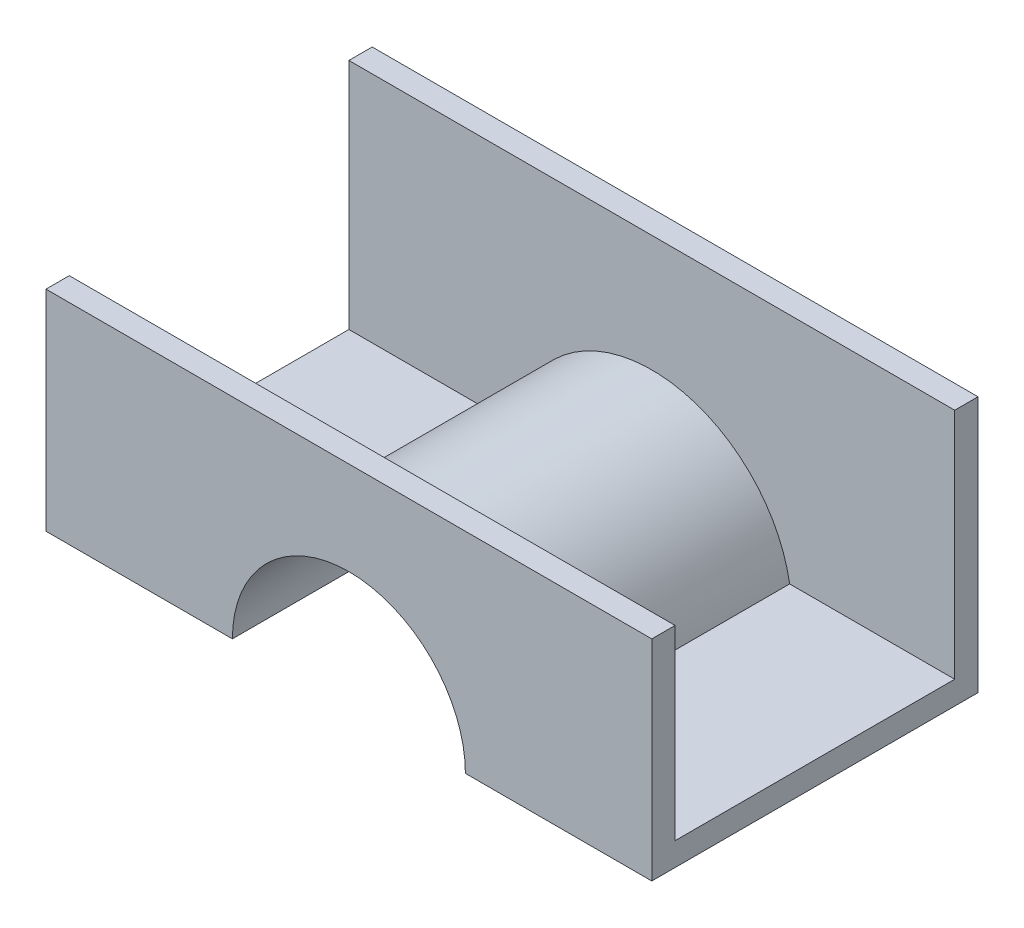
ISO-10303-21;
HEADER;
FILE_DESCRIPTION(('STEP AP214'),'2;1');
FILE_NAME('part.step','',(''),(''),'','','');
FILE_SCHEMA(('AUTOMOTIVE_DESIGN { 1 0 10303 214 1 1 1 1 }'));
ENDSEC;
DATA;
#1=APPLICATION_CONTEXT('core data for automotive mechanical design processes');
#2=APPLICATION_PROTOCOL_DEFINITION('international standard','automotive_design',2000,#1);
#3=PRODUCT_CONTEXT('',#1,'mechanical');
#4=PRODUCT('Part','Part','',(#3));
#5=PRODUCT_RELATED_PRODUCT_CATEGORY('part','',(#4));
#6=PRODUCT_DEFINITION_FORMATION('','',#4);
#7=PRODUCT_DEFINITION_CONTEXT('part definition',#1,'design');
#8=PRODUCT_DEFINITION('design','',#6,#7);
#9=PRODUCT_DEFINITION_SHAPE('','',#8);
#10=(LENGTH_UNIT() NAMED_UNIT(*) SI_UNIT(.MILLI.,.METRE.));
#11=(NAMED_UNIT(*) PLANE_ANGLE_UNIT() SI_UNIT($,.RADIAN.));
#12=(NAMED_UNIT(*) SI_UNIT($,.STERADIAN.) SOLID_ANGLE_UNIT());
#13=UNCERTAINTY_MEASURE_WITH_UNIT(LENGTH_MEASURE(1.E-05),#10,'distance_accuracy_value','');
#14=(GEOMETRIC_REPRESENTATION_CONTEXT(3) GLOBAL_UNCERTAINTY_ASSIGNED_CONTEXT((#13)) GLOBAL_UNIT_ASSIGNED_CONTEXT((#10,
#11,#12)) REPRESENTATION_CONTEXT('',''));
#15=CARTESIAN_POINT('',(0.,0.,0.));
#16=DIRECTION('',(0.,0.,1.));
#17=DIRECTION('',(1.,0.,0.));
#18=AXIS2_PLACEMENT_3D('',#15,#16,#17);
#19=CARTESIAN_POINT('',(-0.0053435001997926,-1.44244159005576,0.00476642100056624));
#20=DIRECTION('',(-1.62409768173737E-13,0.,1.));
#21=DIRECTION('',(1.,0.,1.62409768173737E-13));
#22=AXIS2_PLACEMENT_3D('',#19,#20,#21);
#23=CYLINDRICAL_SURFACE('',#22,0.150000000000034);
#24=CARTESIAN_POINT('',(-0.00534350019984539,-1.44244159005576,0.329766421000602));
#25=DIRECTION('',(-1.62409768173737E-13,0.,1.));
#26=DIRECTION('',(1.,0.,1.62409768173737E-13));
#27=AXIS2_PLACEMENT_3D('',#24,#25,#26);
#28=CIRCLE('',#27,0.150000000000034);
#29=CARTESIAN_POINT('',(0.142558494377718,-1.41744159005576,0.329766421000584));
#30=VERTEX_POINT('',#29);
#31=CARTESIAN_POINT('',(-0.153245494777348,-1.4174415900558,0.329766421000584));
#32=VERTEX_POINT('',#31);
#33=EDGE_CURVE('E11',#30,#32,#28,.T.);
#34=ORIENTED_EDGE('',*,*,#33,.F.);
#35=DIRECTION('',(0.,0.,1.));
#36=VECTOR('',#35,1.);
#37=CARTESIAN_POINT('',(0.142558494377757,-1.41744159005577,0.329766421000566));
#38=LINE('',#37,#36);
#39=CARTESIAN_POINT('',(0.142558494377744,-1.41744159005577,0.0297664210005483));
#40=VERTEX_POINT('',#39);
#41=EDGE_CURVE('E24',#40,#30,#38,.T.);
#42=ORIENTED_EDGE('',*,*,#41,.F.);
#43=CARTESIAN_POINT('',(-0.00534350019979666,-1.44244159005576,0.0297664210005303));
#44=DIRECTION('',(1.62409768173737E-13,0.,-1.));
#45=DIRECTION('',(1.,0.,1.62409768173737E-13));
#46=AXIS2_PLACEMENT_3D('',#43,#44,#45);
#47=CIRCLE('',#46,0.150000000000034);
#48=CARTESIAN_POINT('',(-0.153245494777319,-1.41744159005581,0.0297664210005363));
#49=VERTEX_POINT('',#48);
#50=EDGE_CURVE('E203',#49,#40,#47,.T.);
#51=ORIENTED_EDGE('',*,*,#50,.F.);
#52=DIRECTION('',(0.,0.,-1.));
#53=VECTOR('',#52,1.);
#54=CARTESIAN_POINT('',(-0.153245494777319,-1.4174415900558,0.329766421000566));
#55=LINE('',#54,#53);
#56=EDGE_CURVE('E200',#32,#49,#55,.T.);
#57=ORIENTED_EDGE('',*,*,#56,.F.);
#58=EDGE_LOOP('',(#34,#42,#51,#57));
#59=FACE_BOUND('',#58,.T.);
#60=ADVANCED_FACE('F17',(#59),#23,.T.);
#61=CARTESIAN_POINT('',(0.31965649980025,-1.41744159005575,0.329766421000566));
#62=DIRECTION('',(-1.01196828694583E-13,1.,0.));
#63=DIRECTION('',(-1.,-1.01196828694583E-13,0.));
#64=AXIS2_PLACEMENT_3D('',#61,#62,#63);
#65=PLANE('',#64);
#66=ORIENTED_EDGE('',*,*,#41,.T.);
#67=DIRECTION('',(-1.,0.,0.));
#68=VECTOR('',#67,1.);
#69=CARTESIAN_POINT('',(0.319656499800225,-1.41744159005575,0.329766421000566));
#70=LINE('',#69,#68);
#71=CARTESIAN_POINT('',(0.319656499800244,-1.41744159005575,0.329766421000566));
#72=VERTEX_POINT('',#71);
#73=EDGE_CURVE('E198',#72,#30,#70,.T.);
#74=ORIENTED_EDGE('',*,*,#73,.F.);
#75=DIRECTION('',(0.,0.,1.));
#76=VECTOR('',#75,1.);
#77=CARTESIAN_POINT('',(0.31965649980025,-1.41744159005575,0.354766421000566));
#78=LINE('',#77,#76);
#79=CARTESIAN_POINT('',(0.31965649980025,-1.41744159005576,0.0297664210005663));
#80=VERTEX_POINT('',#79);
#81=EDGE_CURVE('E195',#80,#72,#78,.T.);
#82=ORIENTED_EDGE('',*,*,#81,.F.);
#83=DIRECTION('',(1.,0.,0.));
#84=VECTOR('',#83,1.);
#85=CARTESIAN_POINT('',(-0.00534350019975086,-1.41744159005577,0.0297664210005663));
#86=LINE('',#85,#84);
#87=EDGE_CURVE('E192',#40,#80,#86,.T.);
#88=ORIENTED_EDGE('',*,*,#87,.F.);
#89=EDGE_LOOP('',(#66,#74,#82,#88));
#90=FACE_BOUND('',#89,.T.);
#91=ADVANCED_FACE('F207',(#90),#65,.T.);
#92=CARTESIAN_POINT('',(-0.00534350019981537,-1.2174415900558,0.342266421000566));
#93=DIRECTION('',(-1.01196828694126E-13,1.,0.));
#94=DIRECTION('',(-1.,-1.01196828694126E-13,0.));
#95=AXIS2_PLACEMENT_3D('',#92,#93,#94);
#96=PLANE('',#95);
#97=DIRECTION('',(1.,0.,0.));
#98=VECTOR('',#97,1.);
#99=CARTESIAN_POINT('',(0.319656499800225,-1.21744159005583,0.329766421000566));
#100=LINE('',#99,#98);
#101=CARTESIAN_POINT('',(-0.330343500199747,-1.21744159005583,0.329766421000566));
#102=VERTEX_POINT('',#101);
#103=CARTESIAN_POINT('',(0.31965649980023,-1.21744159005579,0.329766421000566));
#104=VERTEX_POINT('',#103);
#105=EDGE_CURVE('E190',#102,#104,#100,.T.);
#106=ORIENTED_EDGE('',*,*,#105,.F.);
#107=DIRECTION('',(0.,0.,-1.));
#108=VECTOR('',#107,1.);
#109=CARTESIAN_POINT('',(-0.330343500199747,-1.21744159005583,0.329766421000566));
#110=LINE('',#109,#108);
#111=CARTESIAN_POINT('',(-0.330343500199747,-1.21744159005581,0.354766421000566));
#112=VERTEX_POINT('',#111);
#113=EDGE_CURVE('E187',#112,#102,#110,.T.);
#114=ORIENTED_EDGE('',*,*,#113,.F.);
#115=DIRECTION('',(-1.,0.,0.));
#116=VECTOR('',#115,1.);
#117=CARTESIAN_POINT('',(-0.330343500199752,-1.21744159005576,0.354766421000566));
#118=LINE('',#117,#116);
#119=CARTESIAN_POINT('',(0.319656499800238,-1.21744159005576,0.354766421000566));
#120=VERTEX_POINT('',#119);
#121=EDGE_CURVE('E184',#120,#112,#118,.T.);
#122=ORIENTED_EDGE('',*,*,#121,.F.);
#123=DIRECTION('',(0.,0.,1.));
#124=VECTOR('',#123,1.);
#125=CARTESIAN_POINT('',(0.31965649980023,-1.21744159005576,0.354766421000566));
#126=LINE('',#125,#124);
#127=EDGE_CURVE('E181',#104,#120,#126,.T.);
#128=ORIENTED_EDGE('',*,*,#127,.F.);
#129=EDGE_LOOP('',(#106,#114,#122,#128));
#130=FACE_BOUND('',#129,.T.);
#131=ADVANCED_FACE('F226',(#130),#96,.T.);
#132=CARTESIAN_POINT('',(0.319656499800225,-1.16744159005575,0.329766421000566));
#133=DIRECTION('',(0.,0.,-1.));
#134=DIRECTION('',(-1.,0.,0.));
#135=AXIS2_PLACEMENT_3D('',#132,#133,#134);
#136=PLANE('',#135);
#137=ORIENTED_EDGE('',*,*,#73,.T.);
#138=ORIENTED_EDGE('',*,*,#33,.T.);
#139=DIRECTION('',(1.,1.01196828694583E-13,0.));
#140=VECTOR('',#139,1.);
#141=CARTESIAN_POINT('',(0.31965649980025,-1.41744159005575,0.329766421000566));
#142=LINE('',#141,#140);
#143=CARTESIAN_POINT('',(-0.330343500199727,-1.41744159005582,0.329766421000566));
#144=VERTEX_POINT('',#143);
#145=EDGE_CURVE('E178',#144,#32,#142,.T.);
#146=ORIENTED_EDGE('',*,*,#145,.F.);
#147=DIRECTION('',(1.01196828694583E-13,-1.,0.));
#148=VECTOR('',#147,1.);
#149=CARTESIAN_POINT('',(-0.330343500199752,-1.16744159005582,0.329766421000566));
#150=LINE('',#149,#148);
#151=EDGE_CURVE('E175',#102,#144,#150,.T.);
#152=ORIENTED_EDGE('',*,*,#151,.F.);
#153=ORIENTED_EDGE('',*,*,#105,.T.);
#154=DIRECTION('',(-1.01196828694583E-13,1.,0.));
#155=VECTOR('',#154,1.);
#156=CARTESIAN_POINT('',(0.319656499800225,-1.16744159005575,0.329766421000566));
#157=LINE('',#156,#155);
#158=EDGE_CURVE('E172',#72,#104,#157,.T.);
#159=ORIENTED_EDGE('',*,*,#158,.F.);
#160=EDGE_LOOP('',(#137,#138,#146,#152,#153,#159));
#161=FACE_BOUND('',#160,.T.);
#162=ADVANCED_FACE('F209',(#161),#136,.T.);
#163=CARTESIAN_POINT('',(0.31965649980025,-1.41744159005575,0.329766421000566));
#164=DIRECTION('',(-1.01196828694583E-13,1.,0.));
#165=DIRECTION('',(-1.,-1.01196828694583E-13,0.));
#166=AXIS2_PLACEMENT_3D('',#163,#164,#165);
#167=PLANE('',#166);
#168=ORIENTED_EDGE('',*,*,#56,.T.);
#169=DIRECTION('',(1.,0.,0.));
#170=VECTOR('',#169,1.);
#171=CARTESIAN_POINT('',(-0.00534350019975086,-1.41744159005582,0.0297664210005663));
#172=LINE('',#171,#170);
#173=CARTESIAN_POINT('',(-0.330343500199735,-1.41744159005582,0.0297664210005663));
#174=VERTEX_POINT('',#173);
#175=EDGE_CURVE('E169',#174,#49,#172,.T.);
#176=ORIENTED_EDGE('',*,*,#175,.F.);
#177=DIRECTION('',(0.,0.,-1.));
#178=VECTOR('',#177,1.);
#179=CARTESIAN_POINT('',(-0.330343500199727,-1.41744159005582,0.329766421000566));
#180=LINE('',#179,#178);
#181=EDGE_CURVE('E166',#144,#174,#180,.T.);
#182=ORIENTED_EDGE('',*,*,#181,.F.);
#183=ORIENTED_EDGE('',*,*,#145,.T.);
#184=EDGE_LOOP('',(#168,#176,#182,#183));
#185=FACE_BOUND('',#184,.T.);
#186=ADVANCED_FACE('F220',(#185),#167,.T.);
#187=CARTESIAN_POINT('',(-0.00534350019975086,-1.29244159005581,0.0297664210005663));
#188=DIRECTION('',(0.,0.,1.));
#189=DIRECTION('',(1.,0.,0.));
#190=AXIS2_PLACEMENT_3D('',#187,#188,#189);
#191=PLANE('',#190);
#192=DIRECTION('',(1.01196828694583E-13,-1.,0.));
#193=VECTOR('',#192,1.);
#194=CARTESIAN_POINT('',(0.319656499800225,-1.16744159005575,0.0297664210005664));
#195=LINE('',#194,#193);
#196=CARTESIAN_POINT('',(0.319656499800225,-1.16744159005578,0.0297664210005664));
#197=VERTEX_POINT('',#196);
#198=EDGE_CURVE('E163',#197,#80,#195,.T.);
#199=ORIENTED_EDGE('',*,*,#198,.F.);
#200=DIRECTION('',(1.,1.01196828694583E-13,0.));
#201=VECTOR('',#200,1.);
#202=CARTESIAN_POINT('',(-0.330343500199695,-1.16744159005585,0.0297664210005664));
#203=LINE('',#202,#201);
#204=CARTESIAN_POINT('',(-0.330343500199752,-1.16744159005585,0.0297664210005664));
#205=VERTEX_POINT('',#204);
#206=EDGE_CURVE('E160',#205,#197,#203,.T.);
#207=ORIENTED_EDGE('',*,*,#206,.F.);
#208=DIRECTION('',(-1.01196828694583E-13,1.,0.));
#209=VECTOR('',#208,1.);
#210=CARTESIAN_POINT('',(-0.330343500199752,-1.16744159005582,0.0297664210005664));
#211=LINE('',#210,#209);
#212=EDGE_CURVE('E157',#174,#205,#211,.T.);
#213=ORIENTED_EDGE('',*,*,#212,.F.);
#214=ORIENTED_EDGE('',*,*,#175,.T.);
#215=ORIENTED_EDGE('',*,*,#50,.T.);
#216=ORIENTED_EDGE('',*,*,#87,.T.);
#217=EDGE_LOOP('',(#199,#207,#213,#214,#215,#216));
#218=FACE_BOUND('',#217,.T.);
#219=ADVANCED_FACE('F217',(#218),#191,.T.);
#220=CARTESIAN_POINT('',(-0.330343500199752,-1.16744159005582,0.354766421000566));
#221=DIRECTION('',(0.,0.,1.));
#222=DIRECTION('',(1.,0.,0.));
#223=AXIS2_PLACEMENT_3D('',#220,#221,#222);
#224=PLANE('',#223);
#225=DIRECTION('',(-1.,-1.01196828694583E-13,0.));
#226=VECTOR('',#225,1.);
#227=CARTESIAN_POINT('',(-0.130343500199736,-1.4424415900558,0.354766421000546));
#228=LINE('',#227,#226);
#229=CARTESIAN_POINT('',(-0.130343500199792,-1.4424415900558,0.354766421000556));
#230=VERTEX_POINT('',#229);
#231=CARTESIAN_POINT('',(-0.330343500199724,-1.44244159005582,0.354766421000553));
#232=VERTEX_POINT('',#231);
#233=EDGE_CURVE('E155',#230,#232,#228,.T.);
#234=ORIENTED_EDGE('',*,*,#233,.F.);
#235=CARTESIAN_POINT('',(-0.00534350019979253,-1.44244159005582,0.354766421000566));
#236=DIRECTION('',(1.62409768173737E-13,0.,-1.));
#237=DIRECTION('',(1.,0.,1.62409768173737E-13));
#238=AXIS2_PLACEMENT_3D('',#235,#236,#237);
#239=CIRCLE('',#238,0.125);
#240=CARTESIAN_POINT('',(0.119656499800208,-1.4424415900558,0.354766421000576));
#241=VERTEX_POINT('',#240);
#242=EDGE_CURVE('E118',#230,#241,#239,.T.);
#243=ORIENTED_EDGE('',*,*,#242,.T.);
#244=DIRECTION('',(-1.,-1.01196828694583E-13,0.));
#245=VECTOR('',#244,1.);
#246=CARTESIAN_POINT('',(0.144656499800242,-1.44244159005578,0.354766421000566));
#247=LINE('',#246,#245);
#248=CARTESIAN_POINT('',(0.319656499800253,-1.44244159005576,0.354766421000566));
#249=VERTEX_POINT('',#248);
#250=EDGE_CURVE('E151',#249,#241,#247,.T.);
#251=ORIENTED_EDGE('',*,*,#250,.F.);
#252=DIRECTION('',(1.01196828694583E-13,-1.,0.));
#253=VECTOR('',#252,1.);
#254=CARTESIAN_POINT('',(0.319656499800225,-1.16744159005575,0.354766421000566));
#255=LINE('',#254,#253);
#256=EDGE_CURVE('E148',#120,#249,#255,.T.);
#257=ORIENTED_EDGE('',*,*,#256,.F.);
#258=ORIENTED_EDGE('',*,*,#121,.T.);
#259=DIRECTION('',(-1.01196828694583E-13,1.,0.));
#260=VECTOR('',#259,1.);
#261=CARTESIAN_POINT('',(-0.330343500199752,-1.16744159005582,0.354766421000566));
#262=LINE('',#261,#260);
#263=EDGE_CURVE('E145',#232,#112,#262,.T.);
#264=ORIENTED_EDGE('',*,*,#263,.F.);
#265=EDGE_LOOP('',(#234,#243,#251,#257,#258,#264));
#266=FACE_BOUND('',#265,.T.);
#267=ADVANCED_FACE('F228',(#266),#224,.T.);
#268=CARTESIAN_POINT('',(0.144656499800242,-1.44244159005578,0.00476642100056624));
#269=DIRECTION('',(1.01196828694583E-13,-1.,0.));
#270=DIRECTION('',(1.,1.01196828694583E-13,0.));
#271=AXIS2_PLACEMENT_3D('',#268,#269,#270);
#272=PLANE('',#271);
#273=ORIENTED_EDGE('',*,*,#250,.T.);
#274=DIRECTION('',(1.62409768173737E-13,0.,-1.));
#275=VECTOR('',#274,1.);
#276=CARTESIAN_POINT('',(0.119656499800264,-1.44244159005582,0.00476642100060681));
#277=LINE('',#276,#275);
#278=CARTESIAN_POINT('',(0.119656499800264,-1.4424415900558,0.00476642100056623));
#279=VERTEX_POINT('',#278);
#280=EDGE_CURVE('E143',#241,#279,#277,.T.);
#281=ORIENTED_EDGE('',*,*,#280,.T.);
#282=DIRECTION('',(1.,0.,0.));
#283=VECTOR('',#282,1.);
#284=CARTESIAN_POINT('',(-0.00534350019974327,-1.44244159005578,0.00476642100056624));
#285=LINE('',#284,#283);
#286=CARTESIAN_POINT('',(0.319656499800253,-1.44244159005577,0.00476642100056624));
#287=VERTEX_POINT('',#286);
#288=EDGE_CURVE('E123',#279,#287,#285,.T.);
#289=ORIENTED_EDGE('',*,*,#288,.T.);
#290=DIRECTION('',(0.,0.,-1.));
#291=VECTOR('',#290,1.);
#292=CARTESIAN_POINT('',(0.319656499800253,-1.44244159005576,0.354766421000566));
#293=LINE('',#292,#291);
#294=EDGE_CURVE('E139',#249,#287,#293,.T.);
#295=ORIENTED_EDGE('',*,*,#294,.F.);
#296=EDGE_LOOP('',(#273,#281,#289,#295));
#297=FACE_BOUND('',#296,.T.);
#298=ADVANCED_FACE('F231',(#297),#272,.T.);
#299=CARTESIAN_POINT('',(0.319656499800225,-1.16744159005575,0.354766421000566));
#300=DIRECTION('',(1.,1.01196828694583E-13,0.));
#301=DIRECTION('',(-1.01196828694583E-13,1.,0.));
#302=AXIS2_PLACEMENT_3D('',#299,#300,#301);
#303=PLANE('',#302);
#304=DIRECTION('',(0.,0.,-1.));
#305=VECTOR('',#304,1.);
#306=CARTESIAN_POINT('',(0.319656499800225,-1.16744159005578,0.00476642100056629));
#307=LINE('',#306,#305);
#308=CARTESIAN_POINT('',(0.319656499800243,-1.16744159005577,0.00476642100056624));
#309=VERTEX_POINT('',#308);
#310=EDGE_CURVE('E137',#197,#309,#307,.T.);
#311=ORIENTED_EDGE('',*,*,#310,.F.);
#312=ORIENTED_EDGE('',*,*,#198,.T.);
#313=ORIENTED_EDGE('',*,*,#81,.T.);
#314=ORIENTED_EDGE('',*,*,#158,.T.);
#315=ORIENTED_EDGE('',*,*,#127,.T.);
#316=ORIENTED_EDGE('',*,*,#256,.T.);
#317=ORIENTED_EDGE('',*,*,#294,.T.);
#318=DIRECTION('',(0.,1.,0.));
#319=VECTOR('',#318,1.);
#320=CARTESIAN_POINT('',(0.319656499800253,-1.36722081563671,0.00476642100056624));
#321=LINE('',#320,#319);
#322=EDGE_CURVE('E134',#287,#309,#321,.T.);
#323=ORIENTED_EDGE('',*,*,#322,.T.);
#324=EDGE_LOOP('',(#311,#312,#313,#314,#315,#316,#317,#323));
#325=FACE_BOUND('',#324,.T.);
#326=ADVANCED_FACE('F214',(#325),#303,.T.);
#327=CARTESIAN_POINT('',(-0.330343500199695,-1.16744159005585,0.00476642100056629));
#328=DIRECTION('',(-1.01196828694583E-13,1.,0.));
#329=DIRECTION('',(-1.,-1.01196828694583E-13,0.));
#330=AXIS2_PLACEMENT_3D('',#327,#328,#329);
#331=PLANE('',#330);
#332=ORIENTED_EDGE('',*,*,#206,.T.);
#333=ORIENTED_EDGE('',*,*,#310,.T.);
#334=DIRECTION('',(-1.,0.,0.));
#335=VECTOR('',#334,1.);
#336=CARTESIAN_POINT('',(-0.00534350019974327,-1.16744159005576,0.00476642100056624));
#337=LINE('',#336,#335);
#338=CARTESIAN_POINT('',(-0.330343500199727,-1.16744159005579,0.00476642100056624));
#339=VERTEX_POINT('',#338);
#340=EDGE_CURVE('E132',#309,#339,#337,.T.);
#341=ORIENTED_EDGE('',*,*,#340,.T.);
#342=DIRECTION('',(0.,0.,-1.));
#343=VECTOR('',#342,1.);
#344=CARTESIAN_POINT('',(-0.330343500199752,-1.16744159005585,0.329766421000566));
#345=LINE('',#344,#343);
#346=EDGE_CURVE('E129',#205,#339,#345,.T.);
#347=ORIENTED_EDGE('',*,*,#346,.F.);
#348=EDGE_LOOP('',(#332,#333,#341,#347));
#349=FACE_BOUND('',#348,.T.);
#350=ADVANCED_FACE('F239',(#349),#331,.T.);
#351=CARTESIAN_POINT('',(-0.330343500199752,-1.16744159005582,0.329766421000566));
#352=DIRECTION('',(-1.,-1.01196828694583E-13,0.));
#353=DIRECTION('',(1.01196828694583E-13,-1.,0.));
#354=AXIS2_PLACEMENT_3D('',#351,#352,#353);
#355=PLANE('',#354);
#356=ORIENTED_EDGE('',*,*,#346,.T.);
#357=DIRECTION('',(0.,-1.,0.));
#358=VECTOR('',#357,1.);
#359=CARTESIAN_POINT('',(-0.330343500199714,-1.36722081563671,0.00476642100056624));
#360=LINE('',#359,#358);
#361=CARTESIAN_POINT('',(-0.330343500199718,-1.44244159005582,0.00476642100056624));
#362=VERTEX_POINT('',#361);
#363=EDGE_CURVE('E127',#339,#362,#360,.T.);
#364=ORIENTED_EDGE('',*,*,#363,.T.);
#365=DIRECTION('',(0.,0.,-1.));
#366=VECTOR('',#365,1.);
#367=CARTESIAN_POINT('',(-0.330343500199725,-1.44244159005582,0.00476642100056624));
#368=LINE('',#367,#366);
#369=EDGE_CURVE('E107',#232,#362,#368,.T.);
#370=ORIENTED_EDGE('',*,*,#369,.F.);
#371=ORIENTED_EDGE('',*,*,#263,.T.);
#372=ORIENTED_EDGE('',*,*,#113,.T.);
#373=ORIENTED_EDGE('',*,*,#151,.T.);
#374=ORIENTED_EDGE('',*,*,#181,.T.);
#375=ORIENTED_EDGE('',*,*,#212,.T.);
#376=EDGE_LOOP('',(#356,#364,#370,#371,#372,#373,#374,#375));
#377=FACE_BOUND('',#376,.T.);
#378=ADVANCED_FACE('F223',(#377),#355,.T.);
#379=CARTESIAN_POINT('',(-0.130343500199736,-1.4424415900558,0.00476642100056624));
#380=DIRECTION('',(1.01196828694583E-13,-1.,0.));
#381=DIRECTION('',(1.,1.01196828694583E-13,0.));
#382=AXIS2_PLACEMENT_3D('',#379,#380,#381);
#383=PLANE('',#382);
#384=ORIENTED_EDGE('',*,*,#233,.T.);
#385=ORIENTED_EDGE('',*,*,#369,.T.);
#386=DIRECTION('',(1.,0.,0.));
#387=VECTOR('',#386,1.);
#388=CARTESIAN_POINT('',(-0.00534350019974327,-1.44244159005582,0.00476642100056624));
#389=LINE('',#388,#387);
#390=CARTESIAN_POINT('',(-0.130343500199736,-1.44244159005581,0.00476642100055101));
#391=VERTEX_POINT('',#390);
#392=EDGE_CURVE('E102',#362,#391,#389,.T.);
#393=ORIENTED_EDGE('',*,*,#392,.T.);
#394=DIRECTION('',(-1.62409768173737E-13,0.,1.));
#395=VECTOR('',#394,1.);
#396=CARTESIAN_POINT('',(-0.130343500199736,-1.4424415900558,0.00476642100056621));
#397=LINE('',#396,#395);
#398=EDGE_CURVE('E105',#391,#230,#397,.T.);
#399=ORIENTED_EDGE('',*,*,#398,.T.);
#400=EDGE_LOOP('',(#384,#385,#393,#399));
#401=FACE_BOUND('',#400,.T.);
#402=ADVANCED_FACE('F104',(#401),#383,.T.);
#403=CARTESIAN_POINT('',(-0.00534350019973568,-1.44244159005582,0.00476642100058651));
#404=DIRECTION('',(-1.62409768173737E-13,0.,1.));
#405=DIRECTION('',(1.,0.,1.62409768173737E-13));
#406=AXIS2_PLACEMENT_3D('',#403,#404,#405);
#407=CYLINDRICAL_SURFACE('',#406,0.125);
#408=ORIENTED_EDGE('',*,*,#280,.F.);
#409=ORIENTED_EDGE('',*,*,#242,.F.);
#410=ORIENTED_EDGE('',*,*,#398,.F.);
#411=CARTESIAN_POINT('',(-0.00534350019973568,-1.44244159005582,0.00476642100055607));
#412=DIRECTION('',(1.62409768173737E-13,0.,-1.));
#413=DIRECTION('',(1.,0.,1.62409768173737E-13));
#414=AXIS2_PLACEMENT_3D('',#411,#412,#413);
#415=CIRCLE('',#414,0.125);
#416=EDGE_CURVE('E117',#391,#279,#415,.T.);
#417=ORIENTED_EDGE('',*,*,#416,.T.);
#418=EDGE_LOOP('',(#408,#409,#410,#417));
#419=FACE_BOUND('',#418,.T.);
#420=ADVANCED_FACE('F116',(#419),#407,.F.);
#421=CARTESIAN_POINT('',(-0.00534350019974327,-1.36722081563671,0.00476642100056624));
#422=DIRECTION('',(0.,0.,1.));
#423=DIRECTION('',(1.,0.,0.));
#424=AXIS2_PLACEMENT_3D('',#421,#422,#423);
#425=PLANE('',#424);
#426=ORIENTED_EDGE('',*,*,#392,.F.);
#427=ORIENTED_EDGE('',*,*,#363,.F.);
#428=ORIENTED_EDGE('',*,*,#340,.F.);
#429=ORIENTED_EDGE('',*,*,#322,.F.);
#430=ORIENTED_EDGE('',*,*,#288,.F.);
#431=ORIENTED_EDGE('',*,*,#416,.F.);
#432=EDGE_LOOP('',(#426,#427,#428,#429,#430,#431));
#433=FACE_BOUND('',#432,.T.);
#434=ADVANCED_FACE('F121',(#433),#425,.F.);
#435=CLOSED_SHELL('',(#60,#91,#131,#162,#186,#219,#267,#298,#326,#350,#378,#402,#420,#434));
#436=MANIFOLD_SOLID_BREP('B1',#435);
#437=ADVANCED_BREP_SHAPE_REPRESENTATION('',(#18,#436),#14);
#438=SHAPE_DEFINITION_REPRESENTATION(#9,#437);
ENDSEC;
END-ISO-10303-21;
